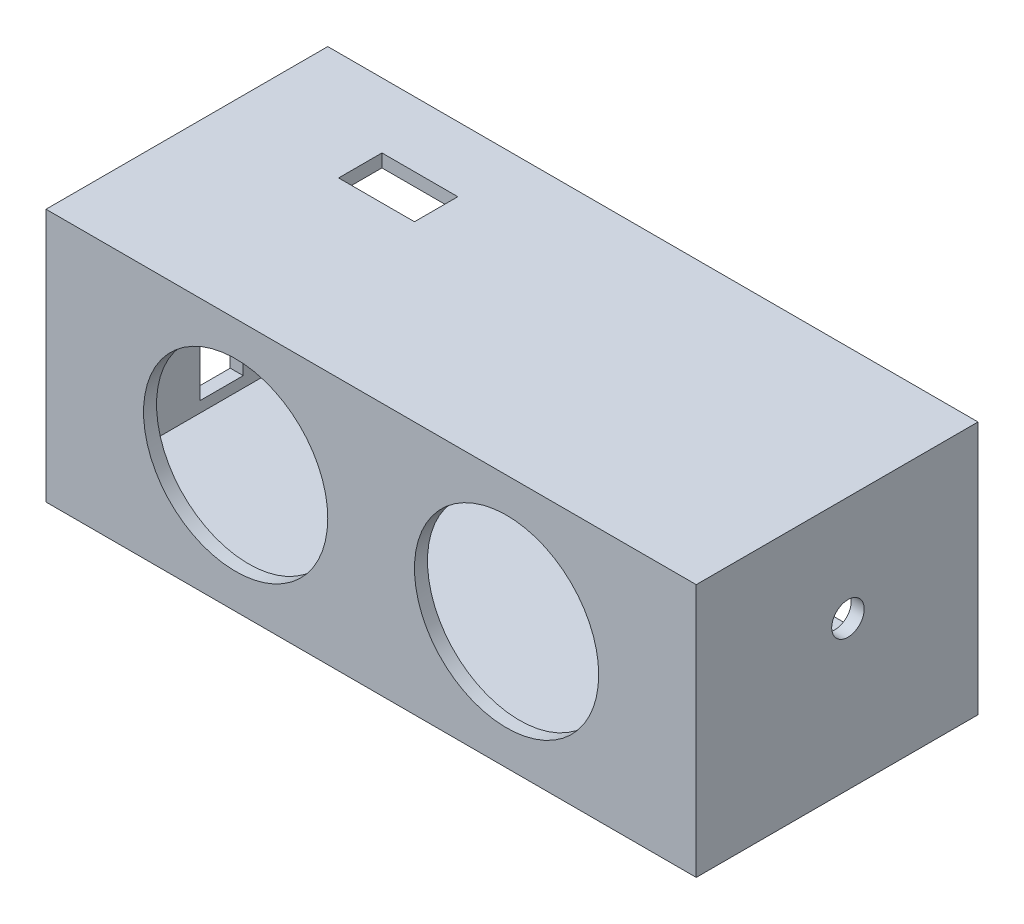
ISO-10303-21;
HEADER;
FILE_DESCRIPTION(('STEP AP214'),'2;1');
FILE_NAME('part.step','',(''),(''),'','','');
FILE_SCHEMA(('AUTOMOTIVE_DESIGN { 1 0 10303 214 1 1 1 1 }'));
ENDSEC;
DATA;
#1=APPLICATION_CONTEXT('core data for automotive mechanical design processes');
#2=APPLICATION_PROTOCOL_DEFINITION('international standard','automotive_design',2000,#1);
#3=PRODUCT_CONTEXT('',#1,'mechanical');
#4=PRODUCT('Part','Part','',(#3));
#5=PRODUCT_RELATED_PRODUCT_CATEGORY('part','',(#4));
#6=PRODUCT_DEFINITION_FORMATION('','',#4);
#7=PRODUCT_DEFINITION_CONTEXT('part definition',#1,'design');
#8=PRODUCT_DEFINITION('design','',#6,#7);
#9=PRODUCT_DEFINITION_SHAPE('','',#8);
#10=(LENGTH_UNIT() NAMED_UNIT(*) SI_UNIT(.MILLI.,.METRE.));
#11=(NAMED_UNIT(*) PLANE_ANGLE_UNIT() SI_UNIT($,.RADIAN.));
#12=(NAMED_UNIT(*) SI_UNIT($,.STERADIAN.) SOLID_ANGLE_UNIT());
#13=UNCERTAINTY_MEASURE_WITH_UNIT(LENGTH_MEASURE(1.E-05),#10,'distance_accuracy_value','');
#14=(GEOMETRIC_REPRESENTATION_CONTEXT(3) GLOBAL_UNCERTAINTY_ASSIGNED_CONTEXT((#13)) GLOBAL_UNIT_ASSIGNED_CONTEXT((#10,
#11,#12)) REPRESENTATION_CONTEXT('',''));
#15=CARTESIAN_POINT('',(0.,0.,0.));
#16=DIRECTION('',(0.,0.,1.));
#17=DIRECTION('',(1.,0.,0.));
#18=AXIS2_PLACEMENT_3D('',#15,#16,#17);
#19=CARTESIAN_POINT('',(-25.7406872275048,14.3287634494972,0.));
#20=DIRECTION('',(1.,0.,0.));
#21=DIRECTION('',(0.,0.,-1.));
#22=AXIS2_PLACEMENT_3D('',#19,#20,#21);
#23=PLANE('',#22);
#24=DIRECTION('',(0.,0.,-1.));
#25=VECTOR('',#24,1.);
#26=CARTESIAN_POINT('',(-25.7406872275048,14.3287634494972,0.));
#27=LINE('',#26,#25);
#28=CARTESIAN_POINT('',(-25.7406872275048,14.3287634494972,0.));
#29=VERTEX_POINT('',#28);
#30=CARTESIAN_POINT('',(-25.7406872275048,14.3287634494972,-26.));
#31=VERTEX_POINT('',#30);
#32=EDGE_CURVE('E356',#29,#31,#27,.T.);
#33=ORIENTED_EDGE('',*,*,#32,.T.);
#34=DIRECTION('',(0.,-1.,0.));
#35=VECTOR('',#34,1.);
#36=CARTESIAN_POINT('',(-25.7406872275048,14.3287634494972,-26.));
#37=LINE('',#36,#35);
#38=CARTESIAN_POINT('',(-25.7406872275048,-9.07123655050282,-26.));
#39=VERTEX_POINT('',#38);
#40=EDGE_CURVE('E296',#31,#39,#37,.T.);
#41=ORIENTED_EDGE('',*,*,#40,.T.);
#42=DIRECTION('',(0.,0.,-1.));
#43=VECTOR('',#42,1.);
#44=CARTESIAN_POINT('',(-25.7406872275048,-9.07123655050282,0.));
#45=LINE('',#44,#43);
#46=CARTESIAN_POINT('',(-25.7406872275048,-9.07123655050282,0.));
#47=VERTEX_POINT('',#46);
#48=EDGE_CURVE('E376',#47,#39,#45,.T.);
#49=ORIENTED_EDGE('',*,*,#48,.F.);
#50=DIRECTION('',(0.,-1.,0.));
#51=VECTOR('',#50,1.);
#52=CARTESIAN_POINT('',(-25.7406872275048,14.3287634494972,0.));
#53=LINE('',#52,#51);
#54=EDGE_CURVE('E368',#29,#47,#53,.T.);
#55=ORIENTED_EDGE('',*,*,#54,.F.);
#56=EDGE_LOOP('',(#33,#41,#49,#55));
#57=FACE_BOUND('',#56,.T.);
#58=DIRECTION('',(0.,1.,0.));
#59=VECTOR('',#58,1.);
#60=CARTESIAN_POINT('',(-25.7406872275048,0.,-17.));
#61=LINE('',#60,#59);
#62=CARTESIAN_POINT('',(-25.7406872275048,-6.87123655050282,-17.));
#63=VERTEX_POINT('',#62);
#64=CARTESIAN_POINT('',(-25.7406872275048,7.12876344949718,-17.));
#65=VERTEX_POINT('',#64);
#66=EDGE_CURVE('E58',#63,#65,#61,.T.);
#67=ORIENTED_EDGE('',*,*,#66,.T.);
#68=DIRECTION('',(0.,0.,1.));
#69=VECTOR('',#68,1.);
#70=CARTESIAN_POINT('',(-25.7406872275048,7.12876344949718,0.));
#71=LINE('',#70,#69);
#72=CARTESIAN_POINT('',(-25.7406872275048,7.12876344949718,-13.));
#73=VERTEX_POINT('',#72);
#74=EDGE_CURVE('E198',#65,#73,#71,.T.);
#75=ORIENTED_EDGE('',*,*,#74,.T.);
#76=DIRECTION('',(0.,1.,0.));
#77=VECTOR('',#76,1.);
#78=CARTESIAN_POINT('',(-25.7406872275048,0.,-13.));
#79=LINE('',#78,#77);
#80=CARTESIAN_POINT('',(-25.7406872275048,-6.87123655050282,-13.));
#81=VERTEX_POINT('',#80);
#82=EDGE_CURVE('E182',#81,#73,#79,.T.);
#83=ORIENTED_EDGE('',*,*,#82,.F.);
#84=DIRECTION('',(0.,0.,1.));
#85=VECTOR('',#84,1.);
#86=CARTESIAN_POINT('',(-25.7406872275048,-6.87123655050282,0.));
#87=LINE('',#86,#85);
#88=EDGE_CURVE('E192',#63,#81,#87,.T.);
#89=ORIENTED_EDGE('',*,*,#88,.F.);
#90=EDGE_LOOP('',(#67,#75,#83,#89));
#91=FACE_BOUND('',#90,.T.);
#92=ADVANCED_FACE('F42',(#57,#91),#23,.F.);
#93=CARTESIAN_POINT('',(-24.5406872275048,13.1287634494972,-26.));
#94=DIRECTION('',(-1.,0.,0.));
#95=DIRECTION('',(0.,-1.,0.));
#96=AXIS2_PLACEMENT_3D('',#93,#94,#95);
#97=PLANE('',#96);
#98=DIRECTION('',(0.,0.,1.));
#99=VECTOR('',#98,1.);
#100=CARTESIAN_POINT('',(-24.5406872275048,13.1287634494972,-26.));
#101=LINE('',#100,#99);
#102=CARTESIAN_POINT('',(-24.5406872275048,13.1287634494972,-26.));
#103=VERTEX_POINT('',#102);
#104=CARTESIAN_POINT('',(-24.5406872275048,13.1287634494972,-1.2));
#105=VERTEX_POINT('',#104);
#106=EDGE_CURVE('E292',#103,#105,#101,.T.);
#107=ORIENTED_EDGE('',*,*,#106,.T.);
#108=DIRECTION('',(0.,-1.,0.));
#109=VECTOR('',#108,1.);
#110=CARTESIAN_POINT('',(-24.5406872275048,0.,-1.2));
#111=LINE('',#110,#109);
#112=CARTESIAN_POINT('',(-24.5406872275048,-7.87123655050282,-1.2));
#113=VERTEX_POINT('',#112);
#114=EDGE_CURVE('E335',#105,#113,#111,.T.);
#115=ORIENTED_EDGE('',*,*,#114,.T.);
#116=DIRECTION('',(0.,0.,1.));
#117=VECTOR('',#116,1.);
#118=CARTESIAN_POINT('',(-24.5406872275048,-7.87123655050282,-26.));
#119=LINE('',#118,#117);
#120=CARTESIAN_POINT('',(-24.5406872275048,-7.87123655050282,-26.));
#121=VERTEX_POINT('',#120);
#122=EDGE_CURVE('E291',#121,#113,#119,.T.);
#123=ORIENTED_EDGE('',*,*,#122,.F.);
#124=DIRECTION('',(0.,-1.,0.));
#125=VECTOR('',#124,1.);
#126=CARTESIAN_POINT('',(-24.5406872275048,13.1287634494972,-26.));
#127=LINE('',#126,#125);
#128=EDGE_CURVE('E266',#103,#121,#127,.T.);
#129=ORIENTED_EDGE('',*,*,#128,.F.);
#130=EDGE_LOOP('',(#107,#115,#123,#129));
#131=FACE_BOUND('',#130,.T.);
#132=DIRECTION('',(0.,1.,0.));
#133=VECTOR('',#132,1.);
#134=CARTESIAN_POINT('',(-24.5406872275048,13.1287634494972,-17.));
#135=LINE('',#134,#133);
#136=CARTESIAN_POINT('',(-24.5406872275048,-6.87123655050282,-17.));
#137=VERTEX_POINT('',#136);
#138=CARTESIAN_POINT('',(-24.5406872275048,7.12876344949718,-17.));
#139=VERTEX_POINT('',#138);
#140=EDGE_CURVE('E12',#137,#139,#135,.T.);
#141=ORIENTED_EDGE('',*,*,#140,.F.);
#142=DIRECTION('',(0.,0.,1.));
#143=VECTOR('',#142,1.);
#144=CARTESIAN_POINT('',(-24.5406872275048,-6.87123655050282,-26.));
#145=LINE('',#144,#143);
#146=CARTESIAN_POINT('',(-24.5406872275048,-6.87123655050282,-13.));
#147=VERTEX_POINT('',#146);
#148=EDGE_CURVE('E427',#137,#147,#145,.T.);
#149=ORIENTED_EDGE('',*,*,#148,.T.);
#150=DIRECTION('',(0.,1.,0.));
#151=VECTOR('',#150,1.);
#152=CARTESIAN_POINT('',(-24.5406872275048,13.1287634494972,-13.));
#153=LINE('',#152,#151);
#154=CARTESIAN_POINT('',(-24.5406872275048,7.12876344949718,-13.));
#155=VERTEX_POINT('',#154);
#156=EDGE_CURVE('E185',#147,#155,#153,.T.);
#157=ORIENTED_EDGE('',*,*,#156,.T.);
#158=DIRECTION('',(0.,0.,1.));
#159=VECTOR('',#158,1.);
#160=CARTESIAN_POINT('',(-24.5406872275048,7.12876344949718,-26.));
#161=LINE('',#160,#159);
#162=EDGE_CURVE('E51',#139,#155,#161,.T.);
#163=ORIENTED_EDGE('',*,*,#162,.F.);
#164=EDGE_LOOP('',(#141,#149,#157,#163));
#165=FACE_BOUND('',#164,.T.);
#166=ADVANCED_FACE('F441',(#131,#165),#97,.F.);
#167=CARTESIAN_POINT('',(-25.7406872275048,14.3287634494972,0.));
#168=DIRECTION('',(0.,-1.,0.));
#169=DIRECTION('',(1.,0.,0.));
#170=AXIS2_PLACEMENT_3D('',#167,#168,#169);
#171=PLANE('',#170);
#172=DIRECTION('',(0.,0.,-1.));
#173=VECTOR('',#172,1.);
#174=CARTESIAN_POINT('',(34.2593127724952,14.3287634494972,0.));
#175=LINE('',#174,#173);
#176=CARTESIAN_POINT('',(34.2593127724952,14.3287634494972,0.));
#177=VERTEX_POINT('',#176);
#178=CARTESIAN_POINT('',(34.2593127724952,14.3287634494972,-26.));
#179=VERTEX_POINT('',#178);
#180=EDGE_CURVE('E355',#177,#179,#175,.T.);
#181=ORIENTED_EDGE('',*,*,#180,.T.);
#182=DIRECTION('',(-1.,0.,0.));
#183=VECTOR('',#182,1.);
#184=CARTESIAN_POINT('',(-25.7406872275048,14.3287634494972,-26.));
#185=LINE('',#184,#183);
#186=EDGE_CURVE('E319',#179,#31,#185,.T.);
#187=ORIENTED_EDGE('',*,*,#186,.T.);
#188=ORIENTED_EDGE('',*,*,#32,.F.);
#189=DIRECTION('',(-1.,0.,0.));
#190=VECTOR('',#189,1.);
#191=CARTESIAN_POINT('',(-25.7406872275048,14.3287634494972,0.));
#192=LINE('',#191,#190);
#193=EDGE_CURVE('E360',#177,#29,#192,.T.);
#194=ORIENTED_EDGE('',*,*,#193,.F.);
#195=EDGE_LOOP('',(#181,#187,#188,#194));
#196=FACE_BOUND('',#195,.T.);
#197=DIRECTION('',(1.,0.,0.));
#198=VECTOR('',#197,1.);
#199=CARTESIAN_POINT('',(0.,14.3287634494972,-20.));
#200=LINE('',#199,#198);
#201=CARTESIAN_POINT('',(-14.7406872275048,14.3287634494972,-20.));
#202=VERTEX_POINT('',#201);
#203=CARTESIAN_POINT('',(-7.74068722750477,14.3287634494972,-20.));
#204=VERTEX_POINT('',#203);
#205=EDGE_CURVE('E217',#202,#204,#200,.T.);
#206=ORIENTED_EDGE('',*,*,#205,.T.);
#207=DIRECTION('',(0.,0.,1.));
#208=VECTOR('',#207,1.);
#209=CARTESIAN_POINT('',(-7.74068722750477,14.3287634494972,0.));
#210=LINE('',#209,#208);
#211=CARTESIAN_POINT('',(-7.74068722750477,14.3287634494972,-16.));
#212=VERTEX_POINT('',#211);
#213=EDGE_CURVE('E229',#204,#212,#210,.T.);
#214=ORIENTED_EDGE('',*,*,#213,.T.);
#215=DIRECTION('',(-1.,0.,0.));
#216=VECTOR('',#215,1.);
#217=CARTESIAN_POINT('',(0.,14.3287634494972,-16.));
#218=LINE('',#217,#216);
#219=CARTESIAN_POINT('',(-14.7406872275048,14.3287634494972,-16.));
#220=VERTEX_POINT('',#219);
#221=EDGE_CURVE('E225',#212,#220,#218,.T.);
#222=ORIENTED_EDGE('',*,*,#221,.T.);
#223=DIRECTION('',(0.,0.,1.));
#224=VECTOR('',#223,1.);
#225=CARTESIAN_POINT('',(-14.7406872275048,14.3287634494972,0.));
#226=LINE('',#225,#224);
#227=EDGE_CURVE('E221',#202,#220,#226,.T.);
#228=ORIENTED_EDGE('',*,*,#227,.F.);
#229=EDGE_LOOP('',(#206,#214,#222,#228));
#230=FACE_BOUND('',#229,.T.);
#231=ADVANCED_FACE('F462',(#196,#230),#171,.F.);
#232=CARTESIAN_POINT('',(-24.5406872275048,13.1287634494972,-26.));
#233=DIRECTION('',(0.,1.,0.));
#234=DIRECTION('',(0.,0.,1.));
#235=AXIS2_PLACEMENT_3D('',#232,#233,#234);
#236=PLANE('',#235);
#237=DIRECTION('',(0.,0.,1.));
#238=VECTOR('',#237,1.);
#239=CARTESIAN_POINT('',(33.0593127724952,13.1287634494972,-26.));
#240=LINE('',#239,#238);
#241=CARTESIAN_POINT('',(33.0593127724952,13.1287634494972,-26.));
#242=VERTEX_POINT('',#241);
#243=CARTESIAN_POINT('',(33.0593127724952,13.1287634494972,-1.2));
#244=VERTEX_POINT('',#243);
#245=EDGE_CURVE('E297',#242,#244,#240,.T.);
#246=ORIENTED_EDGE('',*,*,#245,.T.);
#247=DIRECTION('',(-1.,0.,0.));
#248=VECTOR('',#247,1.);
#249=CARTESIAN_POINT('',(0.,13.1287634494972,-1.2));
#250=LINE('',#249,#248);
#251=EDGE_CURVE('E331',#244,#105,#250,.T.);
#252=ORIENTED_EDGE('',*,*,#251,.T.);
#253=ORIENTED_EDGE('',*,*,#106,.F.);
#254=DIRECTION('',(-1.,0.,0.));
#255=VECTOR('',#254,1.);
#256=CARTESIAN_POINT('',(-24.5406872275048,13.1287634494972,-26.));
#257=LINE('',#256,#255);
#258=EDGE_CURVE('E287',#242,#103,#257,.T.);
#259=ORIENTED_EDGE('',*,*,#258,.F.);
#260=EDGE_LOOP('',(#246,#252,#253,#259));
#261=FACE_BOUND('',#260,.T.);
#262=DIRECTION('',(1.,0.,0.));
#263=VECTOR('',#262,1.);
#264=CARTESIAN_POINT('',(-24.5406872275048,13.1287634494972,-20.));
#265=LINE('',#264,#263);
#266=CARTESIAN_POINT('',(-14.7406872275048,13.1287634494972,-20.));
#267=VERTEX_POINT('',#266);
#268=CARTESIAN_POINT('',(-7.74068722750477,13.1287634494972,-20.));
#269=VERTEX_POINT('',#268);
#270=EDGE_CURVE('E424',#267,#269,#265,.T.);
#271=ORIENTED_EDGE('',*,*,#270,.F.);
#272=DIRECTION('',(0.,0.,1.));
#273=VECTOR('',#272,1.);
#274=CARTESIAN_POINT('',(-14.7406872275048,13.1287634494972,-26.));
#275=LINE('',#274,#273);
#276=CARTESIAN_POINT('',(-14.7406872275048,13.1287634494972,-16.));
#277=VERTEX_POINT('',#276);
#278=EDGE_CURVE('E413',#267,#277,#275,.T.);
#279=ORIENTED_EDGE('',*,*,#278,.T.);
#280=DIRECTION('',(-1.,0.,0.));
#281=VECTOR('',#280,1.);
#282=CARTESIAN_POINT('',(-24.5406872275048,13.1287634494972,-16.));
#283=LINE('',#282,#281);
#284=CARTESIAN_POINT('',(-7.74068722750477,13.1287634494972,-16.));
#285=VERTEX_POINT('',#284);
#286=EDGE_CURVE('E417',#285,#277,#283,.T.);
#287=ORIENTED_EDGE('',*,*,#286,.F.);
#288=DIRECTION('',(0.,0.,1.));
#289=VECTOR('',#288,1.);
#290=CARTESIAN_POINT('',(-7.74068722750476,13.1287634494972,-26.));
#291=LINE('',#290,#289);
#292=EDGE_CURVE('E421',#269,#285,#291,.T.);
#293=ORIENTED_EDGE('',*,*,#292,.F.);
#294=EDGE_LOOP('',(#271,#279,#287,#293));
#295=FACE_BOUND('',#294,.T.);
#296=ADVANCED_FACE('F493',(#261,#295),#236,.F.);
#297=CARTESIAN_POINT('',(-25.7406872275048,-9.07123655050282,0.));
#298=DIRECTION('',(0.,1.,0.));
#299=DIRECTION('',(0.,0.,1.));
#300=AXIS2_PLACEMENT_3D('',#297,#298,#299);
#301=PLANE('',#300);
#302=ORIENTED_EDGE('',*,*,#48,.T.);
#303=DIRECTION('',(1.,0.,0.));
#304=VECTOR('',#303,1.);
#305=CARTESIAN_POINT('',(-25.7406872275048,-9.07123655050282,-26.));
#306=LINE('',#305,#304);
#307=CARTESIAN_POINT('',(34.2593127724952,-9.07123655050282,-26.));
#308=VERTEX_POINT('',#307);
#309=EDGE_CURVE('E311',#39,#308,#306,.T.);
#310=ORIENTED_EDGE('',*,*,#309,.T.);
#311=DIRECTION('',(0.,0.,-1.));
#312=VECTOR('',#311,1.);
#313=CARTESIAN_POINT('',(34.2593127724952,-9.07123655050282,0.));
#314=LINE('',#313,#312);
#315=CARTESIAN_POINT('',(34.2593127724952,-9.07123655050282,0.));
#316=VERTEX_POINT('',#315);
#317=EDGE_CURVE('E359',#316,#308,#314,.T.);
#318=ORIENTED_EDGE('',*,*,#317,.F.);
#319=DIRECTION('',(1.,0.,0.));
#320=VECTOR('',#319,1.);
#321=CARTESIAN_POINT('',(-25.7406872275048,-9.07123655050282,0.));
#322=LINE('',#321,#320);
#323=EDGE_CURVE('E373',#47,#316,#322,.T.);
#324=ORIENTED_EDGE('',*,*,#323,.F.);
#325=EDGE_LOOP('',(#302,#310,#318,#324));
#326=FACE_BOUND('',#325,.T.);
#327=DIRECTION('',(0.,0.,-1.));
#328=VECTOR('',#327,1.);
#329=CARTESIAN_POINT('',(23.5593127724952,-9.07123655050282,0.));
#330=LINE('',#329,#328);
#331=CARTESIAN_POINT('',(23.5593127724952,-9.07123655050282,-9.2));
#332=VERTEX_POINT('',#331);
#333=CARTESIAN_POINT('',(23.5593127724952,-9.07123655050282,-17.2));
#334=VERTEX_POINT('',#333);
#335=EDGE_CURVE('E237',#332,#334,#330,.T.);
#336=ORIENTED_EDGE('',*,*,#335,.T.);
#337=DIRECTION('',(1.,0.,0.));
#338=VECTOR('',#337,1.);
#339=CARTESIAN_POINT('',(0.,-9.07123655050282,-17.2));
#340=LINE('',#339,#338);
#341=CARTESIAN_POINT('',(20.5593127724952,-9.07123655050282,-17.2));
#342=VERTEX_POINT('',#341);
#343=EDGE_CURVE('E258',#342,#334,#340,.T.);
#344=ORIENTED_EDGE('',*,*,#343,.F.);
#345=DIRECTION('',(0.,0.,-1.));
#346=VECTOR('',#345,1.);
#347=CARTESIAN_POINT('',(20.5593127724952,-9.07123655050282,0.));
#348=LINE('',#347,#346);
#349=CARTESIAN_POINT('',(20.5593127724952,-9.07123655050282,-9.2));
#350=VERTEX_POINT('',#349);
#351=EDGE_CURVE('E254',#350,#342,#348,.T.);
#352=ORIENTED_EDGE('',*,*,#351,.F.);
#353=DIRECTION('',(1.,0.,0.));
#354=VECTOR('',#353,1.);
#355=CARTESIAN_POINT('',(0.,-9.07123655050282,-9.2));
#356=LINE('',#355,#354);
#357=EDGE_CURVE('E250',#350,#332,#356,.T.);
#358=ORIENTED_EDGE('',*,*,#357,.T.);
#359=EDGE_LOOP('',(#336,#344,#352,#358));
#360=FACE_BOUND('',#359,.T.);
#361=ADVANCED_FACE('F466',(#326,#360),#301,.F.);
#362=CARTESIAN_POINT('',(-24.5406872275048,-7.87123655050282,-26.));
#363=DIRECTION('',(0.,-1.,0.));
#364=DIRECTION('',(0.,0.,-1.));
#365=AXIS2_PLACEMENT_3D('',#362,#363,#364);
#366=PLANE('',#365);
#367=ORIENTED_EDGE('',*,*,#122,.T.);
#368=DIRECTION('',(1.,0.,0.));
#369=VECTOR('',#368,1.);
#370=CARTESIAN_POINT('',(0.,-7.87123655050282,-1.2));
#371=LINE('',#370,#369);
#372=CARTESIAN_POINT('',(33.0593127724952,-7.87123655050282,-1.20000000000001));
#373=VERTEX_POINT('',#372);
#374=EDGE_CURVE('E323',#113,#373,#371,.T.);
#375=ORIENTED_EDGE('',*,*,#374,.T.);
#376=DIRECTION('',(0.,0.,1.));
#377=VECTOR('',#376,1.);
#378=CARTESIAN_POINT('',(33.0593127724952,-7.87123655050282,-26.));
#379=LINE('',#378,#377);
#380=CARTESIAN_POINT('',(33.0593127724952,-7.87123655050282,-26.));
#381=VERTEX_POINT('',#380);
#382=EDGE_CURVE('E301',#381,#373,#379,.T.);
#383=ORIENTED_EDGE('',*,*,#382,.F.);
#384=DIRECTION('',(1.,0.,0.));
#385=VECTOR('',#384,1.);
#386=CARTESIAN_POINT('',(-24.5406872275048,-7.87123655050282,-26.));
#387=LINE('',#386,#385);
#388=EDGE_CURVE('E279',#121,#381,#387,.T.);
#389=ORIENTED_EDGE('',*,*,#388,.F.);
#390=EDGE_LOOP('',(#367,#375,#383,#389));
#391=FACE_BOUND('',#390,.T.);
#392=DIRECTION('',(0.,0.,-1.));
#393=VECTOR('',#392,1.);
#394=CARTESIAN_POINT('',(23.5593127724952,-7.87123655050282,-26.));
#395=LINE('',#394,#393);
#396=CARTESIAN_POINT('',(23.5593127724952,-7.87123655050282,-9.2));
#397=VERTEX_POINT('',#396);
#398=CARTESIAN_POINT('',(23.5593127724952,-7.87123655050282,-17.2));
#399=VERTEX_POINT('',#398);
#400=EDGE_CURVE('E410',#397,#399,#395,.T.);
#401=ORIENTED_EDGE('',*,*,#400,.F.);
#402=DIRECTION('',(1.,0.,0.));
#403=VECTOR('',#402,1.);
#404=CARTESIAN_POINT('',(-24.5406872275048,-7.87123655050282,-9.2));
#405=LINE('',#404,#403);
#406=CARTESIAN_POINT('',(20.5593127724952,-7.87123655050282,-9.2));
#407=VERTEX_POINT('',#406);
#408=EDGE_CURVE('E372',#407,#397,#405,.T.);
#409=ORIENTED_EDGE('',*,*,#408,.F.);
#410=DIRECTION('',(0.,0.,-1.));
#411=VECTOR('',#410,1.);
#412=CARTESIAN_POINT('',(20.5593127724952,-7.87123655050282,-26.));
#413=LINE('',#412,#411);
#414=CARTESIAN_POINT('',(20.5593127724952,-7.87123655050282,-17.2));
#415=VERTEX_POINT('',#414);
#416=EDGE_CURVE('E402',#407,#415,#413,.T.);
#417=ORIENTED_EDGE('',*,*,#416,.T.);
#418=DIRECTION('',(1.,0.,0.));
#419=VECTOR('',#418,1.);
#420=CARTESIAN_POINT('',(-24.5406872275048,-7.87123655050282,-17.2));
#421=LINE('',#420,#419);
#422=EDGE_CURVE('E406',#415,#399,#421,.T.);
#423=ORIENTED_EDGE('',*,*,#422,.T.);
#424=EDGE_LOOP('',(#401,#409,#417,#423));
#425=FACE_BOUND('',#424,.T.);
#426=ADVANCED_FACE('F478',(#391,#425),#366,.F.);
#427=CARTESIAN_POINT('',(0.,0.,-1.2));
#428=DIRECTION('',(0.,0.,1.));
#429=DIRECTION('',(1.,0.,0.));
#430=AXIS2_PLACEMENT_3D('',#427,#428,#429);
#431=PLANE('',#430);
#432=CARTESIAN_POINT('',(16.7593127724952,2.62876344949718,-1.2));
#433=DIRECTION('',(0.,0.,1.));
#434=DIRECTION('',(1.,0.,0.));
#435=AXIS2_PLACEMENT_3D('',#432,#433,#434);
#436=CIRCLE('',#435,8.5);
#437=CARTESIAN_POINT('',(25.2593127724952,2.62876344949718,-1.2));
#438=VERTEX_POINT('',#437);
#439=EDGE_CURVE('E343',#438,#438,#436,.T.);
#440=ORIENTED_EDGE('',*,*,#439,.T.);
#441=EDGE_LOOP('',(#440));
#442=FACE_BOUND('',#441,.T.);
#443=CARTESIAN_POINT('',(-8.24068722750477,2.62876344949718,-1.2));
#444=DIRECTION('',(0.,0.,1.));
#445=DIRECTION('',(1.,0.,0.));
#446=AXIS2_PLACEMENT_3D('',#443,#444,#445);
#447=CIRCLE('',#446,8.5);
#448=CARTESIAN_POINT('',(0.259312772495232,2.62876344949718,-1.2));
#449=VERTEX_POINT('',#448);
#450=EDGE_CURVE('E351',#449,#449,#447,.T.);
#451=ORIENTED_EDGE('',*,*,#450,.T.);
#452=EDGE_LOOP('',(#451));
#453=FACE_BOUND('',#452,.T.);
#454=ORIENTED_EDGE('',*,*,#114,.F.);
#455=ORIENTED_EDGE('',*,*,#251,.F.);
#456=DIRECTION('',(0.,1.,0.));
#457=VECTOR('',#456,1.);
#458=CARTESIAN_POINT('',(33.0593127724952,0.,-1.2));
#459=LINE('',#458,#457);
#460=EDGE_CURVE('E327',#373,#244,#459,.T.);
#461=ORIENTED_EDGE('',*,*,#460,.F.);
#462=ORIENTED_EDGE('',*,*,#374,.F.);
#463=EDGE_LOOP('',(#454,#455,#461,#462));
#464=FACE_BOUND('',#463,.T.);
#465=ADVANCED_FACE('F44',(#442,#453,#464),#431,.F.);
#466=CARTESIAN_POINT('',(0.,0.,0.));
#467=DIRECTION('',(0.,0.,1.));
#468=DIRECTION('',(1.,0.,0.));
#469=AXIS2_PLACEMENT_3D('',#466,#467,#468);
#470=PLANE('',#469);
#471=ORIENTED_EDGE('',*,*,#193,.T.);
#472=ORIENTED_EDGE('',*,*,#54,.T.);
#473=ORIENTED_EDGE('',*,*,#323,.T.);
#474=DIRECTION('',(0.,1.,0.));
#475=VECTOR('',#474,1.);
#476=CARTESIAN_POINT('',(34.2593127724952,14.3287634494972,0.));
#477=LINE('',#476,#475);
#478=EDGE_CURVE('E379',#316,#177,#477,.T.);
#479=ORIENTED_EDGE('',*,*,#478,.T.);
#480=EDGE_LOOP('',(#471,#472,#473,#479));
#481=FACE_BOUND('',#480,.T.);
#482=CARTESIAN_POINT('',(16.7593127724952,2.62876344949718,0.));
#483=DIRECTION('',(0.,0.,1.));
#484=DIRECTION('',(1.,0.,0.));
#485=AXIS2_PLACEMENT_3D('',#482,#483,#484);
#486=CIRCLE('',#485,8.5);
#487=CARTESIAN_POINT('',(25.2593127724952,2.62876344949718,0.));
#488=VERTEX_POINT('',#487);
#489=EDGE_CURVE('E339',#488,#488,#486,.T.);
#490=ORIENTED_EDGE('',*,*,#489,.F.);
#491=EDGE_LOOP('',(#490));
#492=FACE_BOUND('',#491,.T.);
#493=CARTESIAN_POINT('',(-8.24068722750477,2.62876344949718,0.));
#494=DIRECTION('',(0.,0.,1.));
#495=DIRECTION('',(1.,0.,0.));
#496=AXIS2_PLACEMENT_3D('',#493,#494,#495);
#497=CIRCLE('',#496,8.5);
#498=CARTESIAN_POINT('',(0.259312772495232,2.62876344949718,0.));
#499=VERTEX_POINT('',#498);
#500=EDGE_CURVE('E347',#499,#499,#497,.T.);
#501=ORIENTED_EDGE('',*,*,#500,.F.);
#502=EDGE_LOOP('',(#501));
#503=FACE_BOUND('',#502,.T.);
#504=ADVANCED_FACE('F468',(#481,#492,#503),#470,.T.);
#505=CARTESIAN_POINT('',(34.2593127724952,14.3287634494972,0.));
#506=DIRECTION('',(-1.,0.,0.));
#507=DIRECTION('',(0.,0.,1.));
#508=AXIS2_PLACEMENT_3D('',#505,#506,#507);
#509=PLANE('',#508);
#510=CARTESIAN_POINT('',(34.2593127724952,4.62876344949717,-14.));
#511=DIRECTION('',(1.,0.,0.));
#512=DIRECTION('',(0.,0.,-1.));
#513=AXIS2_PLACEMENT_3D('',#510,#511,#512);
#514=CIRCLE('',#513,1.5);
#515=CARTESIAN_POINT('',(34.2593127724952,4.62876344949717,-15.5));
#516=VERTEX_POINT('',#515);
#517=EDGE_CURVE('E208',#516,#516,#514,.T.);
#518=ORIENTED_EDGE('',*,*,#517,.F.);
#519=EDGE_LOOP('',(#518));
#520=FACE_BOUND('',#519,.T.);
#521=ORIENTED_EDGE('',*,*,#317,.T.);
#522=DIRECTION('',(0.,1.,0.));
#523=VECTOR('',#522,1.);
#524=CARTESIAN_POINT('',(34.2593127724952,14.3287634494972,-26.));
#525=LINE('',#524,#523);
#526=EDGE_CURVE('E315',#308,#179,#525,.T.);
#527=ORIENTED_EDGE('',*,*,#526,.T.);
#528=ORIENTED_EDGE('',*,*,#180,.F.);
#529=ORIENTED_EDGE('',*,*,#478,.F.);
#530=EDGE_LOOP('',(#521,#527,#528,#529));
#531=FACE_BOUND('',#530,.T.);
#532=ADVANCED_FACE('F470',(#520,#531),#509,.F.);
#533=CARTESIAN_POINT('',(-8.24068722750477,2.62876344949718,0.));
#534=DIRECTION('',(0.,0.,-1.));
#535=DIRECTION('',(-1.,0.,0.));
#536=AXIS2_PLACEMENT_3D('',#533,#534,#535);
#537=CYLINDRICAL_SURFACE('',#536,8.5);
#538=ORIENTED_EDGE('',*,*,#500,.T.);
#539=EDGE_LOOP('',(#538));
#540=FACE_BOUND('',#539,.T.);
#541=ORIENTED_EDGE('',*,*,#450,.F.);
#542=EDGE_LOOP('',(#541));
#543=FACE_BOUND('',#542,.T.);
#544=ADVANCED_FACE('F476',(#540,#543),#537,.F.);
#545=CARTESIAN_POINT('',(16.7593127724952,2.62876344949718,0.));
#546=DIRECTION('',(0.,0.,-1.));
#547=DIRECTION('',(-1.,0.,0.));
#548=AXIS2_PLACEMENT_3D('',#545,#546,#547);
#549=CYLINDRICAL_SURFACE('',#548,8.5);
#550=ORIENTED_EDGE('',*,*,#489,.T.);
#551=EDGE_LOOP('',(#550));
#552=FACE_BOUND('',#551,.T.);
#553=ORIENTED_EDGE('',*,*,#439,.F.);
#554=EDGE_LOOP('',(#553));
#555=FACE_BOUND('',#554,.T.);
#556=ADVANCED_FACE('F487',(#552,#555),#549,.F.);
#557=CARTESIAN_POINT('',(33.0593127724952,13.1287634494972,-26.));
#558=DIRECTION('',(1.,0.,0.));
#559=DIRECTION('',(0.,0.,-1.));
#560=AXIS2_PLACEMENT_3D('',#557,#558,#559);
#561=PLANE('',#560);
#562=CARTESIAN_POINT('',(33.0593127724952,4.62876344949717,-14.));
#563=DIRECTION('',(1.,0.,0.));
#564=DIRECTION('',(0.,0.,-1.));
#565=AXIS2_PLACEMENT_3D('',#562,#563,#564);
#566=CIRCLE('',#565,1.5);
#567=CARTESIAN_POINT('',(33.0593127724952,4.62876344949717,-15.5));
#568=VERTEX_POINT('',#567);
#569=EDGE_CURVE('E216',#568,#568,#566,.T.);
#570=ORIENTED_EDGE('',*,*,#569,.T.);
#571=EDGE_LOOP('',(#570));
#572=FACE_BOUND('',#571,.T.);
#573=ORIENTED_EDGE('',*,*,#382,.T.);
#574=ORIENTED_EDGE('',*,*,#460,.T.);
#575=ORIENTED_EDGE('',*,*,#245,.F.);
#576=DIRECTION('',(0.,1.,0.));
#577=VECTOR('',#576,1.);
#578=CARTESIAN_POINT('',(33.0593127724952,13.1287634494972,-26.));
#579=LINE('',#578,#577);
#580=EDGE_CURVE('E283',#381,#242,#579,.T.);
#581=ORIENTED_EDGE('',*,*,#580,.F.);
#582=EDGE_LOOP('',(#573,#574,#575,#581));
#583=FACE_BOUND('',#582,.T.);
#584=ADVANCED_FACE('F503',(#572,#583),#561,.F.);
#585=CARTESIAN_POINT('',(0.,0.,-26.));
#586=DIRECTION('',(0.,0.,1.));
#587=DIRECTION('',(1.,0.,0.));
#588=AXIS2_PLACEMENT_3D('',#585,#586,#587);
#589=PLANE('',#588);
#590=ORIENTED_EDGE('',*,*,#258,.T.);
#591=ORIENTED_EDGE('',*,*,#128,.T.);
#592=ORIENTED_EDGE('',*,*,#388,.T.);
#593=ORIENTED_EDGE('',*,*,#580,.T.);
#594=EDGE_LOOP('',(#590,#591,#592,#593));
#595=FACE_BOUND('',#594,.T.);
#596=ORIENTED_EDGE('',*,*,#40,.F.);
#597=ORIENTED_EDGE('',*,*,#186,.F.);
#598=ORIENTED_EDGE('',*,*,#526,.F.);
#599=ORIENTED_EDGE('',*,*,#309,.F.);
#600=EDGE_LOOP('',(#596,#597,#598,#599));
#601=FACE_BOUND('',#600,.T.);
#602=ADVANCED_FACE('F499',(#595,#601),#589,.F.);
#603=CARTESIAN_POINT('',(23.5593127724952,-5.07123655050282,0.));
#604=DIRECTION('',(-1.,0.,0.));
#605=DIRECTION('',(0.,0.,1.));
#606=AXIS2_PLACEMENT_3D('',#603,#604,#605);
#607=PLANE('',#606);
#608=ORIENTED_EDGE('',*,*,#400,.T.);
#609=DIRECTION('',(0.,-1.,0.));
#610=VECTOR('',#609,1.);
#611=CARTESIAN_POINT('',(23.5593127724952,-5.07123655050282,-17.2));
#612=LINE('',#611,#610);
#613=EDGE_CURVE('E263',#399,#334,#612,.T.);
#614=ORIENTED_EDGE('',*,*,#613,.T.);
#615=ORIENTED_EDGE('',*,*,#335,.F.);
#616=DIRECTION('',(0.,-1.,0.));
#617=VECTOR('',#616,1.);
#618=CARTESIAN_POINT('',(23.5593127724952,-5.07123655050282,-9.2));
#619=LINE('',#618,#617);
#620=EDGE_CURVE('E262',#397,#332,#619,.T.);
#621=ORIENTED_EDGE('',*,*,#620,.F.);
#622=EDGE_LOOP('',(#608,#614,#615,#621));
#623=FACE_BOUND('',#622,.T.);
#624=ADVANCED_FACE('F513',(#623),#607,.T.);
#625=CARTESIAN_POINT('',(0.,-5.07123655050282,-17.2));
#626=DIRECTION('',(0.,0.,-1.));
#627=DIRECTION('',(-1.,0.,0.));
#628=AXIS2_PLACEMENT_3D('',#625,#626,#627);
#629=PLANE('',#628);
#630=DIRECTION('',(0.,-1.,0.));
#631=VECTOR('',#630,1.);
#632=CARTESIAN_POINT('',(20.5593127724952,-5.07123655050282,-17.2));
#633=LINE('',#632,#631);
#634=EDGE_CURVE('E267',#415,#342,#633,.T.);
#635=ORIENTED_EDGE('',*,*,#634,.T.);
#636=ORIENTED_EDGE('',*,*,#343,.T.);
#637=ORIENTED_EDGE('',*,*,#613,.F.);
#638=ORIENTED_EDGE('',*,*,#422,.F.);
#639=EDGE_LOOP('',(#635,#636,#637,#638));
#640=FACE_BOUND('',#639,.T.);
#641=ADVANCED_FACE('F515',(#640),#629,.F.);
#642=CARTESIAN_POINT('',(20.5593127724952,-5.07123655050282,0.));
#643=DIRECTION('',(-1.,0.,0.));
#644=DIRECTION('',(0.,0.,1.));
#645=AXIS2_PLACEMENT_3D('',#642,#643,#644);
#646=PLANE('',#645);
#647=DIRECTION('',(0.,-1.,0.));
#648=VECTOR('',#647,1.);
#649=CARTESIAN_POINT('',(20.5593127724952,-5.07123655050282,-9.2));
#650=LINE('',#649,#648);
#651=EDGE_CURVE('E270',#407,#350,#650,.T.);
#652=ORIENTED_EDGE('',*,*,#651,.T.);
#653=ORIENTED_EDGE('',*,*,#351,.T.);
#654=ORIENTED_EDGE('',*,*,#634,.F.);
#655=ORIENTED_EDGE('',*,*,#416,.F.);
#656=EDGE_LOOP('',(#652,#653,#654,#655));
#657=FACE_BOUND('',#656,.T.);
#658=ADVANCED_FACE('F525',(#657),#646,.F.);
#659=CARTESIAN_POINT('',(0.,-5.07123655050282,-9.2));
#660=DIRECTION('',(0.,0.,-1.));
#661=DIRECTION('',(-1.,0.,0.));
#662=AXIS2_PLACEMENT_3D('',#659,#660,#661);
#663=PLANE('',#662);
#664=ORIENTED_EDGE('',*,*,#408,.T.);
#665=ORIENTED_EDGE('',*,*,#620,.T.);
#666=ORIENTED_EDGE('',*,*,#357,.F.);
#667=ORIENTED_EDGE('',*,*,#651,.F.);
#668=EDGE_LOOP('',(#664,#665,#666,#667));
#669=FACE_BOUND('',#668,.T.);
#670=ADVANCED_FACE('F522',(#669),#663,.T.);
#671=CARTESIAN_POINT('',(0.,10.3287634494972,-20.));
#672=DIRECTION('',(0.,0.,1.));
#673=DIRECTION('',(1.,0.,0.));
#674=AXIS2_PLACEMENT_3D('',#671,#672,#673);
#675=PLANE('',#674);
#676=ORIENTED_EDGE('',*,*,#270,.T.);
#677=DIRECTION('',(0.,1.,0.));
#678=VECTOR('',#677,1.);
#679=CARTESIAN_POINT('',(-7.74068722750477,10.3287634494972,-20.));
#680=LINE('',#679,#678);
#681=EDGE_CURVE('E234',#269,#204,#680,.T.);
#682=ORIENTED_EDGE('',*,*,#681,.T.);
#683=ORIENTED_EDGE('',*,*,#205,.F.);
#684=DIRECTION('',(0.,1.,0.));
#685=VECTOR('',#684,1.);
#686=CARTESIAN_POINT('',(-14.7406872275048,10.3287634494972,-20.));
#687=LINE('',#686,#685);
#688=EDGE_CURVE('E233',#267,#202,#687,.T.);
#689=ORIENTED_EDGE('',*,*,#688,.F.);
#690=EDGE_LOOP('',(#676,#682,#683,#689));
#691=FACE_BOUND('',#690,.T.);
#692=ADVANCED_FACE('F532',(#691),#675,.T.);
#693=CARTESIAN_POINT('',(-7.74068722750477,10.3287634494972,0.));
#694=DIRECTION('',(-1.,0.,0.));
#695=DIRECTION('',(0.,-1.,0.));
#696=AXIS2_PLACEMENT_3D('',#693,#694,#695);
#697=PLANE('',#696);
#698=ORIENTED_EDGE('',*,*,#292,.T.);
#699=DIRECTION('',(0.,1.,0.));
#700=VECTOR('',#699,1.);
#701=CARTESIAN_POINT('',(-7.74068722750477,10.3287634494972,-16.));
#702=LINE('',#701,#700);
#703=EDGE_CURVE('E238',#285,#212,#702,.T.);
#704=ORIENTED_EDGE('',*,*,#703,.T.);
#705=ORIENTED_EDGE('',*,*,#213,.F.);
#706=ORIENTED_EDGE('',*,*,#681,.F.);
#707=EDGE_LOOP('',(#698,#704,#705,#706));
#708=FACE_BOUND('',#707,.T.);
#709=ADVANCED_FACE('F565',(#708),#697,.T.);
#710=CARTESIAN_POINT('',(0.,10.3287634494972,-16.));
#711=DIRECTION('',(0.,0.,-1.));
#712=DIRECTION('',(-1.,0.,0.));
#713=AXIS2_PLACEMENT_3D('',#710,#711,#712);
#714=PLANE('',#713);
#715=ORIENTED_EDGE('',*,*,#286,.T.);
#716=DIRECTION('',(0.,1.,0.));
#717=VECTOR('',#716,1.);
#718=CARTESIAN_POINT('',(-14.7406872275048,10.3287634494972,-16.));
#719=LINE('',#718,#717);
#720=EDGE_CURVE('E241',#277,#220,#719,.T.);
#721=ORIENTED_EDGE('',*,*,#720,.T.);
#722=ORIENTED_EDGE('',*,*,#221,.F.);
#723=ORIENTED_EDGE('',*,*,#703,.F.);
#724=EDGE_LOOP('',(#715,#721,#722,#723));
#725=FACE_BOUND('',#724,.T.);
#726=ADVANCED_FACE('F569',(#725),#714,.T.);
#727=CARTESIAN_POINT('',(-14.7406872275048,10.3287634494972,0.));
#728=DIRECTION('',(-1.,0.,0.));
#729=DIRECTION('',(0.,-1.,0.));
#730=AXIS2_PLACEMENT_3D('',#727,#728,#729);
#731=PLANE('',#730);
#732=ORIENTED_EDGE('',*,*,#688,.T.);
#733=ORIENTED_EDGE('',*,*,#227,.T.);
#734=ORIENTED_EDGE('',*,*,#720,.F.);
#735=ORIENTED_EDGE('',*,*,#278,.F.);
#736=EDGE_LOOP('',(#732,#733,#734,#735));
#737=FACE_BOUND('',#736,.T.);
#738=ADVANCED_FACE('F452',(#737),#731,.F.);
#739=CARTESIAN_POINT('',(30.2593127724952,4.62876344949717,-14.));
#740=DIRECTION('',(1.,0.,0.));
#741=DIRECTION('',(0.,0.,-1.));
#742=AXIS2_PLACEMENT_3D('',#739,#740,#741);
#743=CYLINDRICAL_SURFACE('',#742,1.5);
#744=ORIENTED_EDGE('',*,*,#517,.T.);
#745=EDGE_LOOP('',(#744));
#746=FACE_BOUND('',#745,.T.);
#747=ORIENTED_EDGE('',*,*,#569,.F.);
#748=EDGE_LOOP('',(#747));
#749=FACE_BOUND('',#748,.T.);
#750=ADVANCED_FACE('F445',(#746,#749),#743,.F.);
#751=CARTESIAN_POINT('',(-21.7406872275048,0.,-17.));
#752=DIRECTION('',(0.,0.,1.));
#753=DIRECTION('',(1.,0.,0.));
#754=AXIS2_PLACEMENT_3D('',#751,#752,#753);
#755=PLANE('',#754);
#756=ORIENTED_EDGE('',*,*,#140,.T.);
#757=DIRECTION('',(-1.,0.,0.));
#758=VECTOR('',#757,1.);
#759=CARTESIAN_POINT('',(-21.7406872275048,7.12876344949718,-17.));
#760=LINE('',#759,#758);
#761=EDGE_CURVE('E205',#139,#65,#760,.T.);
#762=ORIENTED_EDGE('',*,*,#761,.T.);
#763=ORIENTED_EDGE('',*,*,#66,.F.);
#764=DIRECTION('',(-1.,0.,0.));
#765=VECTOR('',#764,1.);
#766=CARTESIAN_POINT('',(-21.7406872275048,-6.87123655050282,-17.));
#767=LINE('',#766,#765);
#768=EDGE_CURVE('E189',#137,#63,#767,.T.);
#769=ORIENTED_EDGE('',*,*,#768,.F.);
#770=EDGE_LOOP('',(#756,#762,#763,#769));
#771=FACE_BOUND('',#770,.T.);
#772=ADVANCED_FACE('F442',(#771),#755,.T.);
#773=CARTESIAN_POINT('',(-21.7406872275048,7.12876344949718,0.));
#774=DIRECTION('',(0.,-1.,0.));
#775=DIRECTION('',(0.,0.,-1.));
#776=AXIS2_PLACEMENT_3D('',#773,#774,#775);
#777=PLANE('',#776);
#778=ORIENTED_EDGE('',*,*,#162,.T.);
#779=DIRECTION('',(-1.,0.,0.));
#780=VECTOR('',#779,1.);
#781=CARTESIAN_POINT('',(-21.7406872275048,7.12876344949718,-13.));
#782=LINE('',#781,#780);
#783=EDGE_CURVE('E188',#155,#73,#782,.T.);
#784=ORIENTED_EDGE('',*,*,#783,.T.);
#785=ORIENTED_EDGE('',*,*,#74,.F.);
#786=ORIENTED_EDGE('',*,*,#761,.F.);
#787=EDGE_LOOP('',(#778,#784,#785,#786));
#788=FACE_BOUND('',#787,.T.);
#789=ADVANCED_FACE('F438',(#788),#777,.T.);
#790=CARTESIAN_POINT('',(-21.7406872275048,0.,-13.));
#791=DIRECTION('',(0.,0.,1.));
#792=DIRECTION('',(1.,0.,0.));
#793=AXIS2_PLACEMENT_3D('',#790,#791,#792);
#794=PLANE('',#793);
#795=DIRECTION('',(-1.,0.,0.));
#796=VECTOR('',#795,1.);
#797=CARTESIAN_POINT('',(-21.7406872275048,-6.87123655050282,-13.));
#798=LINE('',#797,#796);
#799=EDGE_CURVE('E66',#147,#81,#798,.T.);
#800=ORIENTED_EDGE('',*,*,#799,.T.);
#801=ORIENTED_EDGE('',*,*,#82,.T.);
#802=ORIENTED_EDGE('',*,*,#783,.F.);
#803=ORIENTED_EDGE('',*,*,#156,.F.);
#804=EDGE_LOOP('',(#800,#801,#802,#803));
#805=FACE_BOUND('',#804,.T.);
#806=ADVANCED_FACE('F179',(#805),#794,.F.);
#807=CARTESIAN_POINT('',(-21.7406872275048,-6.87123655050282,0.));
#808=DIRECTION('',(0.,-1.,0.));
#809=DIRECTION('',(0.,0.,-1.));
#810=AXIS2_PLACEMENT_3D('',#807,#808,#809);
#811=PLANE('',#810);
#812=ORIENTED_EDGE('',*,*,#768,.T.);
#813=ORIENTED_EDGE('',*,*,#88,.T.);
#814=ORIENTED_EDGE('',*,*,#799,.F.);
#815=ORIENTED_EDGE('',*,*,#148,.F.);
#816=EDGE_LOOP('',(#812,#813,#814,#815));
#817=FACE_BOUND('',#816,.T.);
#818=ADVANCED_FACE('F193',(#817),#811,.F.);
#819=CLOSED_SHELL('',(#92,#166,#231,#296,#361,#426,#465,#504,#532,#544,#556,#584,#602,#624,#641,
#658,#670,#692,#709,#726,#738,#750,#772,#789,#806,#818));
#820=MANIFOLD_SOLID_BREP('B2',#819);
#821=ADVANCED_BREP_SHAPE_REPRESENTATION('',(#18,#820),#14);
#822=SHAPE_DEFINITION_REPRESENTATION(#9,#821);
ENDSEC;
END-ISO-10303-21;
